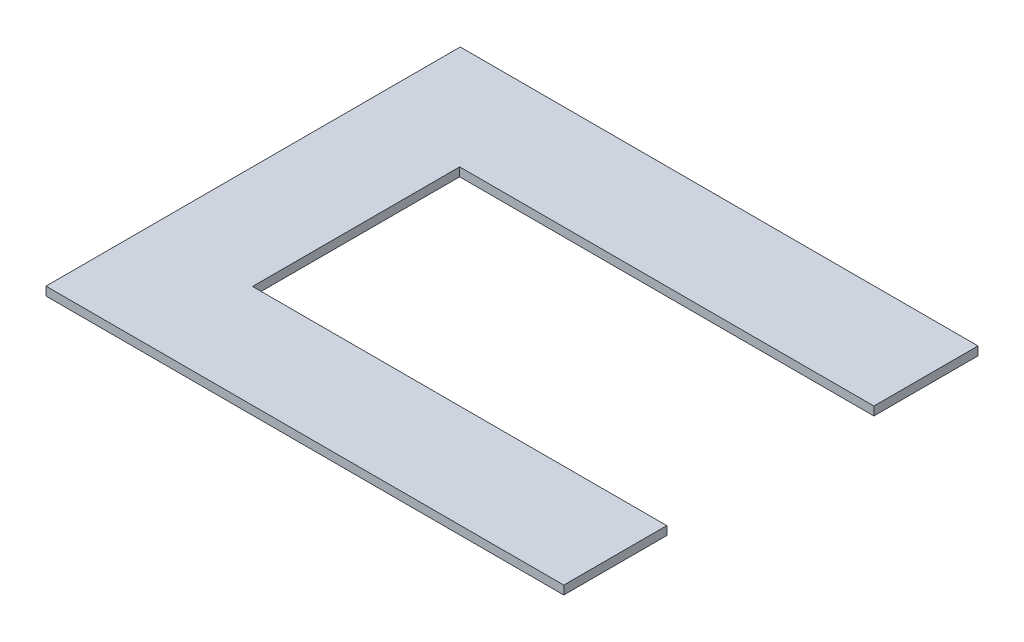
ISO-10303-21;
HEADER;
FILE_DESCRIPTION(('STEP AP214'),'2;1');
FILE_NAME('part.step','',(''),(''),'','','');
FILE_SCHEMA(('AUTOMOTIVE_DESIGN { 1 0 10303 214 1 1 1 1 }'));
ENDSEC;
DATA;
#1=APPLICATION_CONTEXT('core data for automotive mechanical design processes');
#2=APPLICATION_PROTOCOL_DEFINITION('international standard','automotive_design',2000,#1);
#3=PRODUCT_CONTEXT('',#1,'mechanical');
#4=PRODUCT('Part','Part','',(#3));
#5=PRODUCT_RELATED_PRODUCT_CATEGORY('part','',(#4));
#6=PRODUCT_DEFINITION_FORMATION('','',#4);
#7=PRODUCT_DEFINITION_CONTEXT('part definition',#1,'design');
#8=PRODUCT_DEFINITION('design','',#6,#7);
#9=PRODUCT_DEFINITION_SHAPE('','',#8);
#10=(LENGTH_UNIT() NAMED_UNIT(*) SI_UNIT(.MILLI.,.METRE.));
#11=(NAMED_UNIT(*) PLANE_ANGLE_UNIT() SI_UNIT($,.RADIAN.));
#12=(NAMED_UNIT(*) SI_UNIT($,.STERADIAN.) SOLID_ANGLE_UNIT());
#13=UNCERTAINTY_MEASURE_WITH_UNIT(LENGTH_MEASURE(1.E-05),#10,'distance_accuracy_value','');
#14=(GEOMETRIC_REPRESENTATION_CONTEXT(3) GLOBAL_UNCERTAINTY_ASSIGNED_CONTEXT((#13)) GLOBAL_UNIT_ASSIGNED_CONTEXT((#10,
#11,#12)) REPRESENTATION_CONTEXT('',''));
#15=CARTESIAN_POINT('',(0.,0.,0.));
#16=DIRECTION('',(0.,0.,1.));
#17=DIRECTION('',(1.,0.,0.));
#18=AXIS2_PLACEMENT_3D('',#15,#16,#17);
#19=CARTESIAN_POINT('',(0.,6.35,0.));
#20=DIRECTION('',(-1.,0.,0.));
#21=DIRECTION('',(0.,0.,1.));
#22=AXIS2_PLACEMENT_3D('',#19,#20,#21);
#23=PLANE('',#22);
#24=DIRECTION('',(0.,1.,0.));
#25=VECTOR('',#24,1.);
#26=CARTESIAN_POINT('',(0.,0.,-75.7807102757227));
#27=LINE('',#26,#25);
#28=CARTESIAN_POINT('',(0.,0.,-75.7807102757227));
#29=VERTEX_POINT('',#28);
#30=CARTESIAN_POINT('',(0.,6.35,-75.7807102757227));
#31=VERTEX_POINT('',#30);
#32=EDGE_CURVE('E127',#29,#31,#27,.T.);
#33=ORIENTED_EDGE('',*,*,#32,.T.);
#34=DIRECTION('',(0.,0.,-1.));
#35=VECTOR('',#34,1.);
#36=CARTESIAN_POINT('',(0.,6.35,0.));
#37=LINE('',#36,#35);
#38=CARTESIAN_POINT('',(0.,6.35,0.));
#39=VERTEX_POINT('',#38);
#40=EDGE_CURVE('E154',#39,#31,#37,.T.);
#41=ORIENTED_EDGE('',*,*,#40,.F.);
#42=DIRECTION('',(0.,-1.,0.));
#43=VECTOR('',#42,1.);
#44=CARTESIAN_POINT('',(0.,6.35,0.));
#45=LINE('',#44,#43);
#46=CARTESIAN_POINT('',(0.,0.,0.));
#47=VERTEX_POINT('',#46);
#48=EDGE_CURVE('E140',#39,#47,#45,.T.);
#49=ORIENTED_EDGE('',*,*,#48,.T.);
#50=DIRECTION('',(0.,0.,-1.));
#51=VECTOR('',#50,1.);
#52=CARTESIAN_POINT('',(0.,0.,0.));
#53=LINE('',#52,#51);
#54=EDGE_CURVE('E126',#47,#29,#53,.T.);
#55=ORIENTED_EDGE('',*,*,#54,.T.);
#56=EDGE_LOOP('',(#33,#41,#49,#55));
#57=FACE_BOUND('',#56,.T.);
#58=ADVANCED_FACE('F33',(#57),#23,.F.);
#59=CARTESIAN_POINT('',(0.,6.35,0.));
#60=DIRECTION('',(0.,1.,0.));
#61=DIRECTION('',(0.,0.,1.));
#62=AXIS2_PLACEMENT_3D('',#59,#60,#61);
#63=PLANE('',#62);
#64=ORIENTED_EDGE('',*,*,#40,.T.);
#65=DIRECTION('',(-1.,0.,0.));
#66=VECTOR('',#65,1.);
#67=CARTESIAN_POINT('',(0.,6.35,-75.7807102757227));
#68=LINE('',#67,#66);
#69=CARTESIAN_POINT('',(-304.8,6.35,-75.7807102757227));
#70=VERTEX_POINT('',#69);
#71=EDGE_CURVE('E114',#31,#70,#68,.T.);
#72=ORIENTED_EDGE('',*,*,#71,.T.);
#73=DIRECTION('',(0.,0.,-1.));
#74=VECTOR('',#73,1.);
#75=CARTESIAN_POINT('',(-304.8,6.35,-75.7807102757227));
#76=LINE('',#75,#74);
#77=CARTESIAN_POINT('',(-304.8,6.35,-228.180710275723));
#78=VERTEX_POINT('',#77);
#79=EDGE_CURVE('E164',#70,#78,#76,.T.);
#80=ORIENTED_EDGE('',*,*,#79,.T.);
#81=DIRECTION('',(-1.,0.,0.));
#82=VECTOR('',#81,1.);
#83=CARTESIAN_POINT('',(0.,6.35,-228.180710275723));
#84=LINE('',#83,#82);
#85=CARTESIAN_POINT('',(0.,6.35,-228.180710275723));
#86=VERTEX_POINT('',#85);
#87=EDGE_CURVE('E167',#86,#78,#84,.T.);
#88=ORIENTED_EDGE('',*,*,#87,.F.);
#89=CARTESIAN_POINT('',(0.,6.35,-304.8));
#90=VERTEX_POINT('',#89);
#91=EDGE_CURVE('E85',#86,#90,#37,.T.);
#92=ORIENTED_EDGE('',*,*,#91,.T.);
#93=DIRECTION('',(-1.,0.,0.));
#94=VECTOR('',#93,1.);
#95=CARTESIAN_POINT('',(0.,6.35,-304.8));
#96=LINE('',#95,#94);
#97=CARTESIAN_POINT('',(-381.,6.35,-304.8));
#98=VERTEX_POINT('',#97);
#99=EDGE_CURVE('E156',#90,#98,#96,.T.);
#100=ORIENTED_EDGE('',*,*,#99,.T.);
#101=DIRECTION('',(0.,0.,1.));
#102=VECTOR('',#101,1.);
#103=CARTESIAN_POINT('',(-381.,6.35,0.));
#104=LINE('',#103,#102);
#105=CARTESIAN_POINT('',(-381.,6.35,0.));
#106=VERTEX_POINT('',#105);
#107=EDGE_CURVE('E149',#98,#106,#104,.T.);
#108=ORIENTED_EDGE('',*,*,#107,.T.);
#109=DIRECTION('',(1.,0.,0.));
#110=VECTOR('',#109,1.);
#111=CARTESIAN_POINT('',(0.,6.35,0.));
#112=LINE('',#111,#110);
#113=EDGE_CURVE('E57',#106,#39,#112,.T.);
#114=ORIENTED_EDGE('',*,*,#113,.T.);
#115=EDGE_LOOP('',(#64,#72,#80,#88,#92,#100,#108,#114));
#116=FACE_BOUND('',#115,.T.);
#117=ADVANCED_FACE('F176',(#116),#63,.T.);
#118=CARTESIAN_POINT('',(0.,0.,0.));
#119=DIRECTION('',(0.,1.,0.));
#120=DIRECTION('',(0.,0.,1.));
#121=AXIS2_PLACEMENT_3D('',#118,#119,#120);
#122=PLANE('',#121);
#123=DIRECTION('',(-1.,0.,0.));
#124=VECTOR('',#123,1.);
#125=CARTESIAN_POINT('',(0.,0.,-75.7807102757227));
#126=LINE('',#125,#124);
#127=CARTESIAN_POINT('',(-304.8,0.,-75.7807102757227));
#128=VERTEX_POINT('',#127);
#129=EDGE_CURVE('E120',#29,#128,#126,.T.);
#130=ORIENTED_EDGE('',*,*,#129,.F.);
#131=ORIENTED_EDGE('',*,*,#54,.F.);
#132=DIRECTION('',(1.,0.,0.));
#133=VECTOR('',#132,1.);
#134=CARTESIAN_POINT('',(0.,0.,0.));
#135=LINE('',#134,#133);
#136=CARTESIAN_POINT('',(-381.,0.,0.));
#137=VERTEX_POINT('',#136);
#138=EDGE_CURVE('E78',#137,#47,#135,.T.);
#139=ORIENTED_EDGE('',*,*,#138,.F.);
#140=DIRECTION('',(0.,0.,1.));
#141=VECTOR('',#140,1.);
#142=CARTESIAN_POINT('',(-381.,0.,0.));
#143=LINE('',#142,#141);
#144=CARTESIAN_POINT('',(-381.,0.,-304.8));
#145=VERTEX_POINT('',#144);
#146=EDGE_CURVE('E137',#145,#137,#143,.T.);
#147=ORIENTED_EDGE('',*,*,#146,.F.);
#148=DIRECTION('',(-1.,0.,0.));
#149=VECTOR('',#148,1.);
#150=CARTESIAN_POINT('',(0.,0.,-304.8));
#151=LINE('',#150,#149);
#152=CARTESIAN_POINT('',(0.,0.,-304.8));
#153=VERTEX_POINT('',#152);
#154=EDGE_CURVE('E125',#153,#145,#151,.T.);
#155=ORIENTED_EDGE('',*,*,#154,.F.);
#156=CARTESIAN_POINT('',(0.,0.,-228.180710275723));
#157=VERTEX_POINT('',#156);
#158=EDGE_CURVE('E118',#157,#153,#53,.T.);
#159=ORIENTED_EDGE('',*,*,#158,.F.);
#160=DIRECTION('',(-1.,0.,0.));
#161=VECTOR('',#160,1.);
#162=CARTESIAN_POINT('',(0.,0.,-228.180710275723));
#163=LINE('',#162,#161);
#164=CARTESIAN_POINT('',(-304.8,0.,-228.180710275723));
#165=VERTEX_POINT('',#164);
#166=EDGE_CURVE('E106',#157,#165,#163,.T.);
#167=ORIENTED_EDGE('',*,*,#166,.T.);
#168=DIRECTION('',(0.,0.,-1.));
#169=VECTOR('',#168,1.);
#170=CARTESIAN_POINT('',(-304.8,0.,-75.7807102757227));
#171=LINE('',#170,#169);
#172=EDGE_CURVE('E113',#128,#165,#171,.T.);
#173=ORIENTED_EDGE('',*,*,#172,.F.);
#174=EDGE_LOOP('',(#130,#131,#139,#147,#155,#159,#167,#173));
#175=FACE_BOUND('',#174,.T.);
#176=ADVANCED_FACE('F123',(#175),#122,.F.);
#177=ORIENTED_EDGE('',*,*,#91,.F.);
#178=DIRECTION('',(0.,1.,0.));
#179=VECTOR('',#178,1.);
#180=CARTESIAN_POINT('',(0.,0.,-228.180710275723));
#181=LINE('',#180,#179);
#182=EDGE_CURVE('E109',#157,#86,#181,.T.);
#183=ORIENTED_EDGE('',*,*,#182,.F.);
#184=ORIENTED_EDGE('',*,*,#158,.T.);
#185=DIRECTION('',(0.,-1.,0.));
#186=VECTOR('',#185,1.);
#187=CARTESIAN_POINT('',(0.,6.35,-304.8));
#188=LINE('',#187,#186);
#189=EDGE_CURVE('E11',#90,#153,#188,.T.);
#190=ORIENTED_EDGE('',*,*,#189,.F.);
#191=EDGE_LOOP('',(#177,#183,#184,#190));
#192=FACE_BOUND('',#191,.T.);
#193=ADVANCED_FACE('F35',(#192),#23,.F.);
#194=CARTESIAN_POINT('',(0.,6.35,-304.8));
#195=DIRECTION('',(0.,0.,1.));
#196=DIRECTION('',(1.,0.,0.));
#197=AXIS2_PLACEMENT_3D('',#194,#195,#196);
#198=PLANE('',#197);
#199=ORIENTED_EDGE('',*,*,#154,.T.);
#200=DIRECTION('',(0.,-1.,0.));
#201=VECTOR('',#200,1.);
#202=CARTESIAN_POINT('',(-381.,6.35,-304.8));
#203=LINE('',#202,#201);
#204=EDGE_CURVE('E41',#98,#145,#203,.T.);
#205=ORIENTED_EDGE('',*,*,#204,.F.);
#206=ORIENTED_EDGE('',*,*,#99,.F.);
#207=ORIENTED_EDGE('',*,*,#189,.T.);
#208=EDGE_LOOP('',(#199,#205,#206,#207));
#209=FACE_BOUND('',#208,.T.);
#210=ADVANCED_FACE('F190',(#209),#198,.F.);
#211=CARTESIAN_POINT('',(-381.,6.35,0.));
#212=DIRECTION('',(1.,0.,0.));
#213=DIRECTION('',(0.,0.,-1.));
#214=AXIS2_PLACEMENT_3D('',#211,#212,#213);
#215=PLANE('',#214);
#216=ORIENTED_EDGE('',*,*,#146,.T.);
#217=DIRECTION('',(0.,-1.,0.));
#218=VECTOR('',#217,1.);
#219=CARTESIAN_POINT('',(-381.,6.35,0.));
#220=LINE('',#219,#218);
#221=EDGE_CURVE('E142',#106,#137,#220,.T.);
#222=ORIENTED_EDGE('',*,*,#221,.F.);
#223=ORIENTED_EDGE('',*,*,#107,.F.);
#224=ORIENTED_EDGE('',*,*,#204,.T.);
#225=EDGE_LOOP('',(#216,#222,#223,#224));
#226=FACE_BOUND('',#225,.T.);
#227=ADVANCED_FACE('F147',(#226),#215,.F.);
#228=CARTESIAN_POINT('',(0.,6.35,0.));
#229=DIRECTION('',(0.,0.,-1.));
#230=DIRECTION('',(-1.,0.,0.));
#231=AXIS2_PLACEMENT_3D('',#228,#229,#230);
#232=PLANE('',#231);
#233=ORIENTED_EDGE('',*,*,#138,.T.);
#234=ORIENTED_EDGE('',*,*,#48,.F.);
#235=ORIENTED_EDGE('',*,*,#113,.F.);
#236=ORIENTED_EDGE('',*,*,#221,.T.);
#237=EDGE_LOOP('',(#233,#234,#235,#236));
#238=FACE_BOUND('',#237,.T.);
#239=ADVANCED_FACE('F155',(#238),#232,.F.);
#240=CARTESIAN_POINT('',(0.,0.,-75.7807102757227));
#241=DIRECTION('',(0.,0.,-1.));
#242=DIRECTION('',(-1.,0.,0.));
#243=AXIS2_PLACEMENT_3D('',#240,#241,#242);
#244=PLANE('',#243);
#245=ORIENTED_EDGE('',*,*,#71,.F.);
#246=ORIENTED_EDGE('',*,*,#32,.F.);
#247=ORIENTED_EDGE('',*,*,#129,.T.);
#248=DIRECTION('',(0.,1.,0.));
#249=VECTOR('',#248,1.);
#250=CARTESIAN_POINT('',(-304.8,0.,-75.7807102757227));
#251=LINE('',#250,#249);
#252=EDGE_CURVE('E131',#128,#70,#251,.T.);
#253=ORIENTED_EDGE('',*,*,#252,.T.);
#254=EDGE_LOOP('',(#245,#246,#247,#253));
#255=FACE_BOUND('',#254,.T.);
#256=ADVANCED_FACE('F175',(#255),#244,.T.);
#257=CARTESIAN_POINT('',(-304.8,0.,-75.7807102757227));
#258=DIRECTION('',(1.,0.,0.));
#259=DIRECTION('',(0.,0.,-1.));
#260=AXIS2_PLACEMENT_3D('',#257,#258,#259);
#261=PLANE('',#260);
#262=ORIENTED_EDGE('',*,*,#79,.F.);
#263=ORIENTED_EDGE('',*,*,#252,.F.);
#264=ORIENTED_EDGE('',*,*,#172,.T.);
#265=DIRECTION('',(0.,1.,0.));
#266=VECTOR('',#265,1.);
#267=CARTESIAN_POINT('',(-304.8,0.,-228.180710275723));
#268=LINE('',#267,#266);
#269=EDGE_CURVE('E48',#165,#78,#268,.T.);
#270=ORIENTED_EDGE('',*,*,#269,.T.);
#271=EDGE_LOOP('',(#262,#263,#264,#270));
#272=FACE_BOUND('',#271,.T.);
#273=ADVANCED_FACE('F173',(#272),#261,.T.);
#274=CARTESIAN_POINT('',(0.,0.,-228.180710275723));
#275=DIRECTION('',(0.,0.,-1.));
#276=DIRECTION('',(-1.,0.,0.));
#277=AXIS2_PLACEMENT_3D('',#274,#275,#276);
#278=PLANE('',#277);
#279=ORIENTED_EDGE('',*,*,#87,.T.);
#280=ORIENTED_EDGE('',*,*,#269,.F.);
#281=ORIENTED_EDGE('',*,*,#166,.F.);
#282=ORIENTED_EDGE('',*,*,#182,.T.);
#283=EDGE_LOOP('',(#279,#280,#281,#282));
#284=FACE_BOUND('',#283,.T.);
#285=ADVANCED_FACE('F108',(#284),#278,.F.);
#286=CLOSED_SHELL('',(#58,#117,#176,#193,#210,#227,#239,#256,#273,#285));
#287=MANIFOLD_SOLID_BREP('B2',#286);
#288=ADVANCED_BREP_SHAPE_REPRESENTATION('',(#18,#287),#14);
#289=SHAPE_DEFINITION_REPRESENTATION(#9,#288);
ENDSEC;
END-ISO-10303-21;
